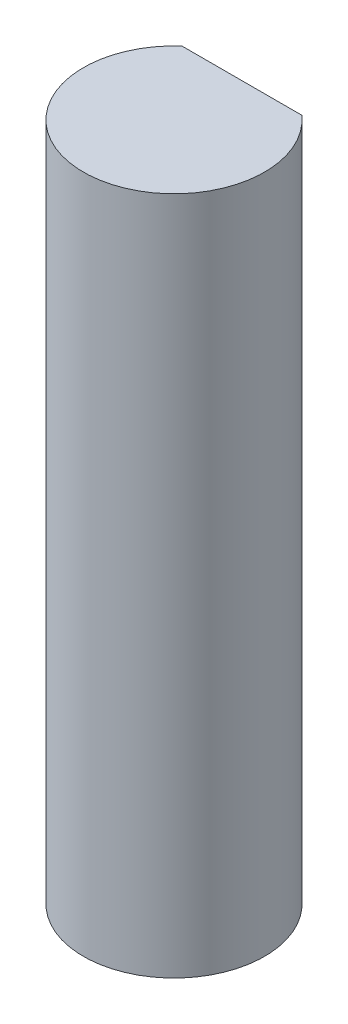
ISO-10303-21;
HEADER;
FILE_DESCRIPTION(('STEP AP214'),'2;1');
FILE_NAME('part.step','',(''),(''),'','','');
FILE_SCHEMA(('AUTOMOTIVE_DESIGN { 1 0 10303 214 1 1 1 1 }'));
ENDSEC;
DATA;
#1=APPLICATION_CONTEXT('core data for automotive mechanical design processes');
#2=APPLICATION_PROTOCOL_DEFINITION('international standard','automotive_design',2000,#1);
#3=PRODUCT_CONTEXT('',#1,'mechanical');
#4=PRODUCT('Part','Part','',(#3));
#5=PRODUCT_RELATED_PRODUCT_CATEGORY('part','',(#4));
#6=PRODUCT_DEFINITION_FORMATION('','',#4);
#7=PRODUCT_DEFINITION_CONTEXT('part definition',#1,'design');
#8=PRODUCT_DEFINITION('design','',#6,#7);
#9=PRODUCT_DEFINITION_SHAPE('','',#8);
#10=(LENGTH_UNIT() NAMED_UNIT(*) SI_UNIT(.MILLI.,.METRE.));
#11=(NAMED_UNIT(*) PLANE_ANGLE_UNIT() SI_UNIT($,.RADIAN.));
#12=(NAMED_UNIT(*) SI_UNIT($,.STERADIAN.) SOLID_ANGLE_UNIT());
#13=UNCERTAINTY_MEASURE_WITH_UNIT(LENGTH_MEASURE(1.E-05),#10,'distance_accuracy_value','');
#14=(GEOMETRIC_REPRESENTATION_CONTEXT(3) GLOBAL_UNCERTAINTY_ASSIGNED_CONTEXT((#13)) GLOBAL_UNIT_ASSIGNED_CONTEXT((#10,
#11,#12)) REPRESENTATION_CONTEXT('',''));
#15=CARTESIAN_POINT('',(0.,0.,0.));
#16=DIRECTION('',(0.,0.,1.));
#17=DIRECTION('',(1.,0.,0.));
#18=AXIS2_PLACEMENT_3D('',#15,#16,#17);
#19=CARTESIAN_POINT('',(0.,15.,0.));
#20=DIRECTION('',(0.,-1.,0.));
#21=DIRECTION('',(0.,0.,-1.));
#22=AXIS2_PLACEMENT_3D('',#19,#20,#21);
#23=CYLINDRICAL_SURFACE('',#22,2.);
#24=CARTESIAN_POINT('',(0.,0.,0.));
#25=DIRECTION('',(0.,1.,0.));
#26=DIRECTION('',(0.,0.,1.));
#27=AXIS2_PLACEMENT_3D('',#24,#25,#26);
#28=CIRCLE('',#27,2.);
#29=CARTESIAN_POINT('',(-1.3228756555323,0.,-1.5));
#30=VERTEX_POINT('',#29);
#31=CARTESIAN_POINT('',(1.3228756555323,0.,-1.5));
#32=VERTEX_POINT('',#31);
#33=EDGE_CURVE('E67',#30,#32,#28,.T.);
#34=ORIENTED_EDGE('',*,*,#33,.T.);
#35=DIRECTION('',(0.,-1.,0.));
#36=VECTOR('',#35,1.);
#37=CARTESIAN_POINT('',(1.3228756555323,15.,-1.5));
#38=LINE('',#37,#36);
#39=CARTESIAN_POINT('',(1.3228756555323,15.,-1.5));
#40=VERTEX_POINT('',#39);
#41=EDGE_CURVE('E11',#40,#32,#38,.T.);
#42=ORIENTED_EDGE('',*,*,#41,.F.);
#43=CARTESIAN_POINT('',(0.,15.,0.));
#44=DIRECTION('',(0.,1.,0.));
#45=DIRECTION('',(0.,0.,1.));
#46=AXIS2_PLACEMENT_3D('',#43,#44,#45);
#47=CIRCLE('',#46,2.);
#48=CARTESIAN_POINT('',(-1.3228756555323,15.,-1.5));
#49=VERTEX_POINT('',#48);
#50=EDGE_CURVE('E66',#49,#40,#47,.T.);
#51=ORIENTED_EDGE('',*,*,#50,.F.);
#52=DIRECTION('',(0.,-1.,0.));
#53=VECTOR('',#52,1.);
#54=CARTESIAN_POINT('',(-1.3228756555323,15.,-1.5));
#55=LINE('',#54,#53);
#56=EDGE_CURVE('E44',#49,#30,#55,.T.);
#57=ORIENTED_EDGE('',*,*,#56,.T.);
#58=EDGE_LOOP('',(#34,#42,#51,#57));
#59=FACE_BOUND('',#58,.T.);
#60=ADVANCED_FACE('F36',(#59),#23,.T.);
#61=CARTESIAN_POINT('',(-1.3228756555323,15.,-1.5));
#62=DIRECTION('',(0.,0.,1.));
#63=DIRECTION('',(1.,0.,0.));
#64=AXIS2_PLACEMENT_3D('',#61,#62,#63);
#65=PLANE('',#64);
#66=DIRECTION('',(-1.,0.,0.));
#67=VECTOR('',#66,1.);
#68=CARTESIAN_POINT('',(-1.3228756555323,0.,-1.5));
#69=LINE('',#68,#67);
#70=EDGE_CURVE('E59',#32,#30,#69,.T.);
#71=ORIENTED_EDGE('',*,*,#70,.T.);
#72=ORIENTED_EDGE('',*,*,#56,.F.);
#73=DIRECTION('',(-1.,0.,0.));
#74=VECTOR('',#73,1.);
#75=CARTESIAN_POINT('',(-1.3228756555323,15.,-1.5));
#76=LINE('',#75,#74);
#77=EDGE_CURVE('E51',#40,#49,#76,.T.);
#78=ORIENTED_EDGE('',*,*,#77,.F.);
#79=ORIENTED_EDGE('',*,*,#41,.T.);
#80=EDGE_LOOP('',(#71,#72,#78,#79));
#81=FACE_BOUND('',#80,.T.);
#82=ADVANCED_FACE('F62',(#81),#65,.F.);
#83=CARTESIAN_POINT('',(0.,15.,0.));
#84=DIRECTION('',(0.,1.,0.));
#85=DIRECTION('',(0.,0.,1.));
#86=AXIS2_PLACEMENT_3D('',#83,#84,#85);
#87=PLANE('',#86);
#88=ORIENTED_EDGE('',*,*,#50,.T.);
#89=ORIENTED_EDGE('',*,*,#77,.T.);
#90=EDGE_LOOP('',(#88,#89));
#91=FACE_BOUND('',#90,.T.);
#92=ADVANCED_FACE('F74',(#91),#87,.T.);
#93=CARTESIAN_POINT('',(0.,0.,0.));
#94=DIRECTION('',(0.,1.,0.));
#95=DIRECTION('',(0.,0.,1.));
#96=AXIS2_PLACEMENT_3D('',#93,#94,#95);
#97=PLANE('',#96);
#98=ORIENTED_EDGE('',*,*,#33,.F.);
#99=ORIENTED_EDGE('',*,*,#70,.F.);
#100=EDGE_LOOP('',(#98,#99));
#101=FACE_BOUND('',#100,.T.);
#102=ADVANCED_FACE('F70',(#101),#97,.F.);
#103=CLOSED_SHELL('',(#60,#82,#92,#102));
#104=MANIFOLD_SOLID_BREP('B2',#103);
#105=ADVANCED_BREP_SHAPE_REPRESENTATION('',(#18,#104),#14);
#106=SHAPE_DEFINITION_REPRESENTATION(#9,#105);
ENDSEC;
END-ISO-10303-21;
